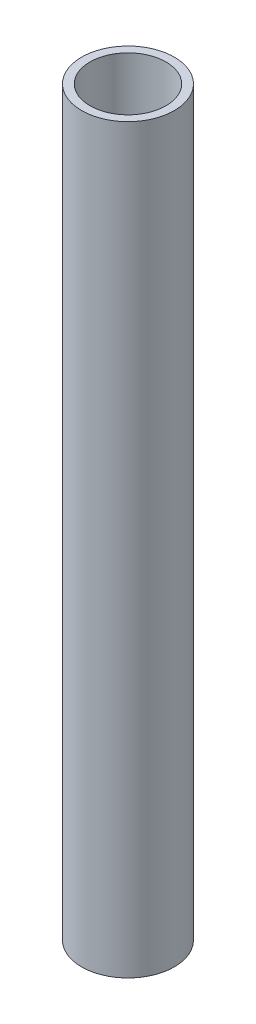
ISO-10303-21;
HEADER;
FILE_DESCRIPTION(('STEP AP214'),'2;1');
FILE_NAME('part.step','',(''),(''),'','','');
FILE_SCHEMA(('AUTOMOTIVE_DESIGN { 1 0 10303 214 1 1 1 1 }'));
ENDSEC;
DATA;
#1=APPLICATION_CONTEXT('core data for automotive mechanical design processes');
#2=APPLICATION_PROTOCOL_DEFINITION('international standard','automotive_design',2000,#1);
#3=PRODUCT_CONTEXT('',#1,'mechanical');
#4=PRODUCT('Part','Part','',(#3));
#5=PRODUCT_RELATED_PRODUCT_CATEGORY('part','',(#4));
#6=PRODUCT_DEFINITION_FORMATION('','',#4);
#7=PRODUCT_DEFINITION_CONTEXT('part definition',#1,'design');
#8=PRODUCT_DEFINITION('design','',#6,#7);
#9=PRODUCT_DEFINITION_SHAPE('','',#8);
#10=(LENGTH_UNIT() NAMED_UNIT(*) SI_UNIT(.MILLI.,.METRE.));
#11=(NAMED_UNIT(*) PLANE_ANGLE_UNIT() SI_UNIT($,.RADIAN.));
#12=(NAMED_UNIT(*) SI_UNIT($,.STERADIAN.) SOLID_ANGLE_UNIT());
#13=UNCERTAINTY_MEASURE_WITH_UNIT(LENGTH_MEASURE(1.E-05),#10,'distance_accuracy_value','');
#14=(GEOMETRIC_REPRESENTATION_CONTEXT(3) GLOBAL_UNCERTAINTY_ASSIGNED_CONTEXT((#13)) GLOBAL_UNIT_ASSIGNED_CONTEXT((#10,
#11,#12)) REPRESENTATION_CONTEXT('',''));
#15=CARTESIAN_POINT('',(0.,0.,0.));
#16=DIRECTION('',(0.,0.,1.));
#17=DIRECTION('',(1.,0.,0.));
#18=AXIS2_PLACEMENT_3D('',#15,#16,#17);
#19=CARTESIAN_POINT('',(0.,203.2,0.));
#20=DIRECTION('',(0.,1.,0.));
#21=DIRECTION('',(0.,0.,1.));
#22=AXIS2_PLACEMENT_3D('',#19,#20,#21);
#23=PLANE('',#22);
#24=CARTESIAN_POINT('',(0.,203.2,0.));
#25=DIRECTION('',(0.,1.,0.));
#26=DIRECTION('',(0.,0.,1.));
#27=AXIS2_PLACEMENT_3D('',#24,#25,#26);
#28=CIRCLE('',#27,12.7);
#29=CARTESIAN_POINT('',(0.,203.2,12.7));
#30=VERTEX_POINT('',#29);
#31=EDGE_CURVE('E10',#30,#30,#28,.T.);
#32=ORIENTED_EDGE('',*,*,#31,.T.);
#33=EDGE_LOOP('',(#32));
#34=FACE_BOUND('',#33,.T.);
#35=CARTESIAN_POINT('',(0.,203.2,0.));
#36=DIRECTION('',(0.,1.,0.));
#37=DIRECTION('',(0.,0.,1.));
#38=AXIS2_PLACEMENT_3D('',#35,#36,#37);
#39=CIRCLE('',#38,10.414);
#40=CARTESIAN_POINT('',(0.,203.2,10.414));
#41=VERTEX_POINT('',#40);
#42=EDGE_CURVE('E42',#41,#41,#39,.T.);
#43=ORIENTED_EDGE('',*,*,#42,.F.);
#44=EDGE_LOOP('',(#43));
#45=FACE_BOUND('',#44,.T.);
#46=ADVANCED_FACE('F31',(#34,#45),#23,.T.);
#47=CARTESIAN_POINT('',(0.,0.,0.));
#48=DIRECTION('',(0.,1.,0.));
#49=DIRECTION('',(0.,0.,1.));
#50=AXIS2_PLACEMENT_3D('',#47,#48,#49);
#51=PLANE('',#50);
#52=CARTESIAN_POINT('',(0.,0.,0.));
#53=DIRECTION('',(0.,1.,0.));
#54=DIRECTION('',(0.,0.,1.));
#55=AXIS2_PLACEMENT_3D('',#52,#53,#54);
#56=CIRCLE('',#55,12.7);
#57=CARTESIAN_POINT('',(0.,0.,12.7));
#58=VERTEX_POINT('',#57);
#59=EDGE_CURVE('E35',#58,#58,#56,.T.);
#60=ORIENTED_EDGE('',*,*,#59,.F.);
#61=EDGE_LOOP('',(#60));
#62=FACE_BOUND('',#61,.T.);
#63=CARTESIAN_POINT('',(0.,0.,0.));
#64=DIRECTION('',(0.,1.,0.));
#65=DIRECTION('',(0.,0.,1.));
#66=AXIS2_PLACEMENT_3D('',#63,#64,#65);
#67=CIRCLE('',#66,10.414);
#68=CARTESIAN_POINT('',(0.,0.,10.414));
#69=VERTEX_POINT('',#68);
#70=EDGE_CURVE('E44',#69,#69,#67,.T.);
#71=ORIENTED_EDGE('',*,*,#70,.T.);
#72=EDGE_LOOP('',(#71));
#73=FACE_BOUND('',#72,.T.);
#74=ADVANCED_FACE('F54',(#62,#73),#51,.F.);
#75=CARTESIAN_POINT('',(0.,203.2,0.));
#76=DIRECTION('',(0.,-1.,0.));
#77=DIRECTION('',(0.,0.,-1.));
#78=AXIS2_PLACEMENT_3D('',#75,#76,#77);
#79=CYLINDRICAL_SURFACE('',#78,12.7);
#80=ORIENTED_EDGE('',*,*,#31,.F.);
#81=EDGE_LOOP('',(#80));
#82=FACE_BOUND('',#81,.T.);
#83=ORIENTED_EDGE('',*,*,#59,.T.);
#84=EDGE_LOOP('',(#83));
#85=FACE_BOUND('',#84,.T.);
#86=ADVANCED_FACE('F33',(#82,#85),#79,.T.);
#87=CARTESIAN_POINT('',(0.,203.2,0.));
#88=DIRECTION('',(0.,-1.,0.));
#89=DIRECTION('',(0.,0.,-1.));
#90=AXIS2_PLACEMENT_3D('',#87,#88,#89);
#91=CYLINDRICAL_SURFACE('',#90,10.414);
#92=ORIENTED_EDGE('',*,*,#42,.T.);
#93=EDGE_LOOP('',(#92));
#94=FACE_BOUND('',#93,.T.);
#95=ORIENTED_EDGE('',*,*,#70,.F.);
#96=EDGE_LOOP('',(#95));
#97=FACE_BOUND('',#96,.T.);
#98=ADVANCED_FACE('F50',(#94,#97),#91,.F.);
#99=CLOSED_SHELL('',(#46,#74,#86,#98));
#100=MANIFOLD_SOLID_BREP('B2',#99);
#101=ADVANCED_BREP_SHAPE_REPRESENTATION('',(#18,#100),#14);
#102=SHAPE_DEFINITION_REPRESENTATION(#9,#101);
ENDSEC;
END-ISO-10303-21;
